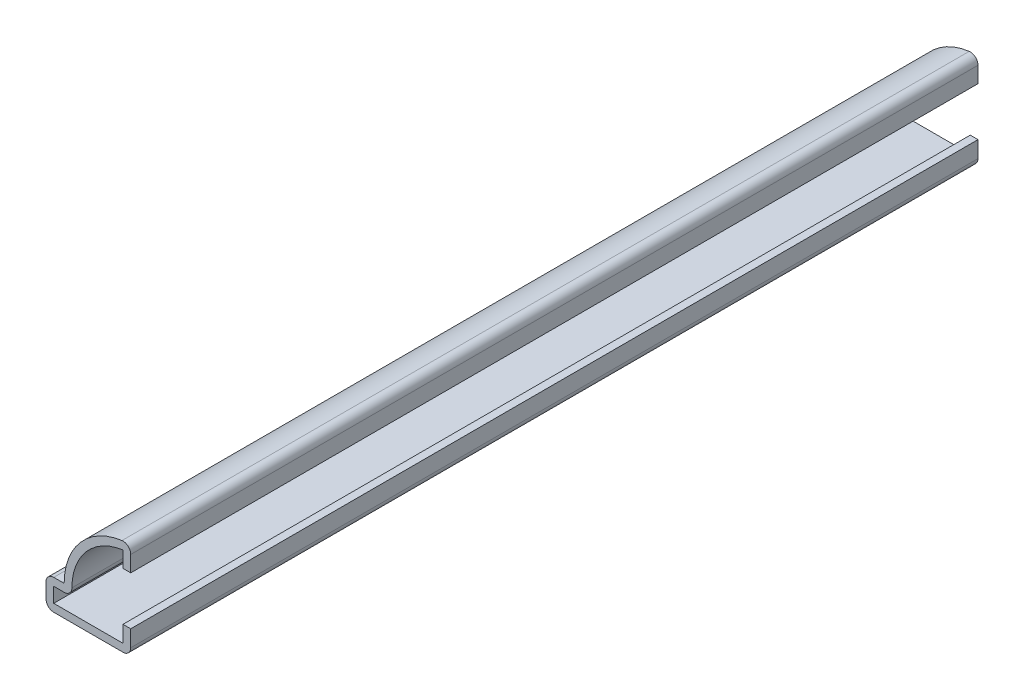
ISO-10303-21;
HEADER;
FILE_DESCRIPTION(('STEP AP214'),'2;1');
FILE_NAME('part.step','',(''),(''),'','','');
FILE_SCHEMA(('AUTOMOTIVE_DESIGN { 1 0 10303 214 1 1 1 1 }'));
ENDSEC;
DATA;
#1=APPLICATION_CONTEXT('core data for automotive mechanical design processes');
#2=APPLICATION_PROTOCOL_DEFINITION('international standard','automotive_design',2000,#1);
#3=PRODUCT_CONTEXT('',#1,'mechanical');
#4=PRODUCT('Part','Part','',(#3));
#5=PRODUCT_RELATED_PRODUCT_CATEGORY('part','',(#4));
#6=PRODUCT_DEFINITION_FORMATION('','',#4);
#7=PRODUCT_DEFINITION_CONTEXT('part definition',#1,'design');
#8=PRODUCT_DEFINITION('design','',#6,#7);
#9=PRODUCT_DEFINITION_SHAPE('','',#8);
#10=(LENGTH_UNIT() NAMED_UNIT(*) SI_UNIT(.MILLI.,.METRE.));
#11=(NAMED_UNIT(*) PLANE_ANGLE_UNIT() SI_UNIT($,.RADIAN.));
#12=(NAMED_UNIT(*) SI_UNIT($,.STERADIAN.) SOLID_ANGLE_UNIT());
#13=UNCERTAINTY_MEASURE_WITH_UNIT(LENGTH_MEASURE(1.E-05),#10,'distance_accuracy_value','');
#14=(GEOMETRIC_REPRESENTATION_CONTEXT(3) GLOBAL_UNCERTAINTY_ASSIGNED_CONTEXT((#13)) GLOBAL_UNIT_ASSIGNED_CONTEXT((#10,
#11,#12)) REPRESENTATION_CONTEXT('',''));
#15=CARTESIAN_POINT('',(0.,0.,0.));
#16=DIRECTION('',(0.,0.,1.));
#17=DIRECTION('',(1.,0.,0.));
#18=AXIS2_PLACEMENT_3D('',#15,#16,#17);
#19=CARTESIAN_POINT('',(-1.0160000000001,12.7,-111.125));
#20=DIRECTION('',(-1.,0.,0.));
#21=DIRECTION('',(0.,0.,1.));
#22=AXIS2_PLACEMENT_3D('',#19,#20,#21);
#23=PLANE('',#22);
#24=DIRECTION('',(0.,1.,0.));
#25=VECTOR('',#24,1.);
#26=CARTESIAN_POINT('',(-1.0160000000001,12.7,0.));
#27=LINE('',#26,#25);
#28=CARTESIAN_POINT('',(-1.0160000000001,11.6168103137332,0.));
#29=VERTEX_POINT('',#28);
#30=CARTESIAN_POINT('',(-1.0160000000001,9.52500000000003,0.));
#31=VERTEX_POINT('',#30);
#32=EDGE_CURVE('E224',#29,#31,#27,.F.);
#33=ORIENTED_EDGE('',*,*,#32,.F.);
#34=DIRECTION('',(0.,0.,1.));
#35=VECTOR('',#34,1.);
#36=CARTESIAN_POINT('',(-1.0160000000001,11.6168103137332,-111.125));
#37=LINE('',#36,#35);
#38=CARTESIAN_POINT('',(-1.0160000000001,11.6168103137332,-111.125));
#39=VERTEX_POINT('',#38);
#40=EDGE_CURVE('E190',#39,#29,#37,.T.);
#41=ORIENTED_EDGE('',*,*,#40,.F.);
#42=DIRECTION('',(0.,1.,0.));
#43=VECTOR('',#42,1.);
#44=CARTESIAN_POINT('',(-1.0160000000001,12.7,-111.125));
#45=LINE('',#44,#43);
#46=CARTESIAN_POINT('',(-1.0160000000001,9.52500000000003,-111.125));
#47=VERTEX_POINT('',#46);
#48=EDGE_CURVE('E171',#39,#47,#45,.F.);
#49=ORIENTED_EDGE('',*,*,#48,.T.);
#50=DIRECTION('',(0.,0.,1.));
#51=VECTOR('',#50,1.);
#52=CARTESIAN_POINT('',(-1.0160000000001,9.52500000000003,-111.125));
#53=LINE('',#52,#51);
#54=EDGE_CURVE('E178',#47,#31,#53,.T.);
#55=ORIENTED_EDGE('',*,*,#54,.T.);
#56=EDGE_LOOP('',(#33,#41,#49,#55));
#57=FACE_BOUND('',#56,.T.);
#58=ADVANCED_FACE('F35',(#57),#23,.T.);
#59=CARTESIAN_POINT('',(0.,3.96875000000001,-111.125));
#60=DIRECTION('',(0.,0.,1.));
#61=DIRECTION('',(1.,0.,0.));
#62=AXIS2_PLACEMENT_3D('',#59,#60,#61);
#63=CYLINDRICAL_SURFACE('',#62,7.71525000000003);
#64=CARTESIAN_POINT('',(0.,3.96875000000001,0.));
#65=DIRECTION('',(0.,0.,1.));
#66=DIRECTION('',(1.,0.,0.));
#67=AXIS2_PLACEMENT_3D('',#64,#65,#66);
#68=CIRCLE('',#67,7.71525000000003);
#69=CARTESIAN_POINT('',(-7.71525000000003,3.96875000000002,0.));
#70=VERTEX_POINT('',#69);
#71=EDGE_CURVE('E191',#70,#29,#68,.F.);
#72=ORIENTED_EDGE('',*,*,#71,.F.);
#73=DIRECTION('',(0.,0.,1.));
#74=VECTOR('',#73,1.);
#75=CARTESIAN_POINT('',(-7.71525000000003,3.96875000000002,-111.125));
#76=LINE('',#75,#74);
#77=CARTESIAN_POINT('',(-7.71525000000003,3.96875000000002,-111.125));
#78=VERTEX_POINT('',#77);
#79=EDGE_CURVE('E306',#70,#78,#76,.F.);
#80=ORIENTED_EDGE('',*,*,#79,.T.);
#81=CARTESIAN_POINT('',(0.,3.96875000000001,-111.125));
#82=DIRECTION('',(0.,0.,1.));
#83=DIRECTION('',(1.,0.,0.));
#84=AXIS2_PLACEMENT_3D('',#81,#82,#83);
#85=CIRCLE('',#84,7.71525000000003);
#86=EDGE_CURVE('E186',#78,#39,#85,.F.);
#87=ORIENTED_EDGE('',*,*,#86,.T.);
#88=ORIENTED_EDGE('',*,*,#40,.T.);
#89=EDGE_LOOP('',(#72,#80,#87,#88));
#90=FACE_BOUND('',#89,.T.);
#91=ADVANCED_FACE('F322',(#90),#63,.F.);
#92=CARTESIAN_POINT('',(-11.1125,2.95275000000002,-111.125));
#93=DIRECTION('',(0.,-1.,0.));
#94=DIRECTION('',(1.,0.,0.));
#95=AXIS2_PLACEMENT_3D('',#92,#93,#94);
#96=PLANE('',#95);
#97=DIRECTION('',(1.,0.,0.));
#98=VECTOR('',#97,1.);
#99=CARTESIAN_POINT('',(-11.1125,2.95275000000002,-111.125));
#100=LINE('',#99,#98);
#101=CARTESIAN_POINT('',(-10.0965,2.95275000000002,-111.125));
#102=VERTEX_POINT('',#101);
#103=CARTESIAN_POINT('',(-8.73125000000003,2.95275000000002,-111.125));
#104=VERTEX_POINT('',#103);
#105=EDGE_CURVE('E220',#102,#104,#100,.T.);
#106=ORIENTED_EDGE('',*,*,#105,.T.);
#107=DIRECTION('',(0.,0.,1.));
#108=VECTOR('',#107,1.);
#109=CARTESIAN_POINT('',(-8.73125000000003,2.95275000000002,-111.125));
#110=LINE('',#109,#108);
#111=CARTESIAN_POINT('',(-8.73125000000003,2.95275000000002,0.));
#112=VERTEX_POINT('',#111);
#113=EDGE_CURVE('E303',#104,#112,#110,.T.);
#114=ORIENTED_EDGE('',*,*,#113,.T.);
#115=DIRECTION('',(1.,0.,0.));
#116=VECTOR('',#115,1.);
#117=CARTESIAN_POINT('',(-11.1125,2.95275000000002,0.));
#118=LINE('',#117,#116);
#119=CARTESIAN_POINT('',(-10.0965,2.95275000000002,0.));
#120=VERTEX_POINT('',#119);
#121=EDGE_CURVE('E193',#120,#112,#118,.T.);
#122=ORIENTED_EDGE('',*,*,#121,.F.);
#123=DIRECTION('',(0.,0.,1.));
#124=VECTOR('',#123,1.);
#125=CARTESIAN_POINT('',(-10.0965,2.95275000000002,-111.125));
#126=LINE('',#125,#124);
#127=EDGE_CURVE('E257',#102,#120,#126,.T.);
#128=ORIENTED_EDGE('',*,*,#127,.F.);
#129=EDGE_LOOP('',(#106,#114,#122,#128));
#130=FACE_BOUND('',#129,.T.);
#131=ADVANCED_FACE('F330',(#130),#96,.T.);
#132=CARTESIAN_POINT('',(-10.0965,0.,-111.125));
#133=DIRECTION('',(1.,0.,0.));
#134=DIRECTION('',(0.,0.,-1.));
#135=AXIS2_PLACEMENT_3D('',#132,#133,#134);
#136=PLANE('',#135);
#137=DIRECTION('',(0.,1.,0.));
#138=VECTOR('',#137,1.);
#139=CARTESIAN_POINT('',(-10.0965,0.,0.));
#140=LINE('',#139,#138);
#141=CARTESIAN_POINT('',(-10.0965,1.016,0.));
#142=VERTEX_POINT('',#141);
#143=EDGE_CURVE('E250',#142,#120,#140,.T.);
#144=ORIENTED_EDGE('',*,*,#143,.F.);
#145=DIRECTION('',(0.,0.,1.));
#146=VECTOR('',#145,1.);
#147=CARTESIAN_POINT('',(-10.0965,1.016,-111.125));
#148=LINE('',#147,#146);
#149=CARTESIAN_POINT('',(-10.0965,1.016,-111.125));
#150=VERTEX_POINT('',#149);
#151=EDGE_CURVE('E259',#150,#142,#148,.T.);
#152=ORIENTED_EDGE('',*,*,#151,.F.);
#153=DIRECTION('',(0.,1.,0.));
#154=VECTOR('',#153,1.);
#155=CARTESIAN_POINT('',(-10.0965,0.,-111.125));
#156=LINE('',#155,#154);
#157=EDGE_CURVE('E217',#150,#102,#156,.T.);
#158=ORIENTED_EDGE('',*,*,#157,.T.);
#159=ORIENTED_EDGE('',*,*,#127,.T.);
#160=EDGE_LOOP('',(#144,#152,#158,#159));
#161=FACE_BOUND('',#160,.T.);
#162=ADVANCED_FACE('F334',(#161),#136,.T.);
#163=CARTESIAN_POINT('',(0.,1.016,-111.125));
#164=DIRECTION('',(0.,1.,0.));
#165=DIRECTION('',(-1.,0.,0.));
#166=AXIS2_PLACEMENT_3D('',#163,#164,#165);
#167=PLANE('',#166);
#168=DIRECTION('',(-1.,0.,0.));
#169=VECTOR('',#168,1.);
#170=CARTESIAN_POINT('',(0.,1.016,0.));
#171=LINE('',#170,#169);
#172=CARTESIAN_POINT('',(-1.016,1.016,0.));
#173=VERTEX_POINT('',#172);
#174=EDGE_CURVE('E247',#173,#142,#171,.T.);
#175=ORIENTED_EDGE('',*,*,#174,.F.);
#176=DIRECTION('',(0.,0.,1.));
#177=VECTOR('',#176,1.);
#178=CARTESIAN_POINT('',(-1.016,1.016,-111.125));
#179=LINE('',#178,#177);
#180=CARTESIAN_POINT('',(-1.016,1.016,-111.125));
#181=VERTEX_POINT('',#180);
#182=EDGE_CURVE('E261',#181,#173,#179,.T.);
#183=ORIENTED_EDGE('',*,*,#182,.F.);
#184=DIRECTION('',(-1.,0.,0.));
#185=VECTOR('',#184,1.);
#186=CARTESIAN_POINT('',(0.,1.016,-111.125));
#187=LINE('',#186,#185);
#188=EDGE_CURVE('E214',#181,#150,#187,.T.);
#189=ORIENTED_EDGE('',*,*,#188,.T.);
#190=ORIENTED_EDGE('',*,*,#151,.T.);
#191=EDGE_LOOP('',(#175,#183,#189,#190));
#192=FACE_BOUND('',#191,.T.);
#193=ADVANCED_FACE('F339',(#192),#167,.T.);
#194=CARTESIAN_POINT('',(-1.016,3.17500000000001,-111.125));
#195=DIRECTION('',(-1.,0.,0.));
#196=DIRECTION('',(0.,0.,1.));
#197=AXIS2_PLACEMENT_3D('',#194,#195,#196);
#198=PLANE('',#197);
#199=DIRECTION('',(0.,1.,0.));
#200=VECTOR('',#199,1.);
#201=CARTESIAN_POINT('',(-1.016,3.17500000000001,0.));
#202=LINE('',#201,#200);
#203=CARTESIAN_POINT('',(-1.016,3.17500000000001,0.));
#204=VERTEX_POINT('',#203);
#205=EDGE_CURVE('E244',#204,#173,#202,.F.);
#206=ORIENTED_EDGE('',*,*,#205,.F.);
#207=DIRECTION('',(0.,0.,1.));
#208=VECTOR('',#207,1.);
#209=CARTESIAN_POINT('',(-1.016,3.17500000000001,-111.125));
#210=LINE('',#209,#208);
#211=CARTESIAN_POINT('',(-1.016,3.17500000000001,-111.125));
#212=VERTEX_POINT('',#211);
#213=EDGE_CURVE('E263',#212,#204,#210,.T.);
#214=ORIENTED_EDGE('',*,*,#213,.F.);
#215=DIRECTION('',(0.,1.,0.));
#216=VECTOR('',#215,1.);
#217=CARTESIAN_POINT('',(-1.016,3.17500000000001,-111.125));
#218=LINE('',#217,#216);
#219=EDGE_CURVE('E211',#212,#181,#218,.F.);
#220=ORIENTED_EDGE('',*,*,#219,.T.);
#221=ORIENTED_EDGE('',*,*,#182,.T.);
#222=EDGE_LOOP('',(#206,#214,#220,#221));
#223=FACE_BOUND('',#222,.T.);
#224=ADVANCED_FACE('F342',(#223),#198,.T.);
#225=CARTESIAN_POINT('',(-1.016,3.17500000000001,-111.125));
#226=DIRECTION('',(0.,-1.,0.));
#227=DIRECTION('',(0.,0.,-1.));
#228=AXIS2_PLACEMENT_3D('',#225,#226,#227);
#229=PLANE('',#228);
#230=DIRECTION('',(1.,0.,0.));
#231=VECTOR('',#230,1.);
#232=CARTESIAN_POINT('',(-1.016,3.17500000000001,0.));
#233=LINE('',#232,#231);
#234=CARTESIAN_POINT('',(0.,3.17500000000001,0.));
#235=VERTEX_POINT('',#234);
#236=EDGE_CURVE('E242',#204,#235,#233,.T.);
#237=ORIENTED_EDGE('',*,*,#236,.T.);
#238=DIRECTION('',(0.,0.,1.));
#239=VECTOR('',#238,1.);
#240=CARTESIAN_POINT('',(0.,3.17500000000001,-111.125));
#241=LINE('',#240,#239);
#242=CARTESIAN_POINT('',(0.,3.17500000000001,-111.125));
#243=VERTEX_POINT('',#242);
#244=EDGE_CURVE('E265',#243,#235,#241,.T.);
#245=ORIENTED_EDGE('',*,*,#244,.F.);
#246=DIRECTION('',(1.,0.,0.));
#247=VECTOR('',#246,1.);
#248=CARTESIAN_POINT('',(-1.016,3.17500000000001,-111.125));
#249=LINE('',#248,#247);
#250=EDGE_CURVE('E209',#212,#243,#249,.T.);
#251=ORIENTED_EDGE('',*,*,#250,.F.);
#252=ORIENTED_EDGE('',*,*,#213,.T.);
#253=EDGE_LOOP('',(#237,#245,#251,#252));
#254=FACE_BOUND('',#253,.T.);
#255=ADVANCED_FACE('F348',(#254),#229,.F.);
#256=CARTESIAN_POINT('',(0.,3.17500000000001,-111.125));
#257=DIRECTION('',(-1.,0.,0.));
#258=DIRECTION('',(0.,0.,1.));
#259=AXIS2_PLACEMENT_3D('',#256,#257,#258);
#260=PLANE('',#259);
#261=DIRECTION('',(0.,-1.,0.));
#262=VECTOR('',#261,1.);
#263=CARTESIAN_POINT('',(0.,3.17500000000001,0.));
#264=LINE('',#263,#262);
#265=CARTESIAN_POINT('',(0.,1.016,0.));
#266=VERTEX_POINT('',#265);
#267=EDGE_CURVE('E239',#235,#266,#264,.T.);
#268=ORIENTED_EDGE('',*,*,#267,.T.);
#269=DIRECTION('',(0.,0.,1.));
#270=VECTOR('',#269,1.);
#271=CARTESIAN_POINT('',(0.,1.016,-111.125));
#272=LINE('',#271,#270);
#273=CARTESIAN_POINT('',(0.,1.016,-111.125));
#274=VERTEX_POINT('',#273);
#275=EDGE_CURVE('E308',#266,#274,#272,.F.);
#276=ORIENTED_EDGE('',*,*,#275,.T.);
#277=DIRECTION('',(0.,-1.,0.));
#278=VECTOR('',#277,1.);
#279=CARTESIAN_POINT('',(0.,3.17500000000001,-111.125));
#280=LINE('',#279,#278);
#281=EDGE_CURVE('E206',#243,#274,#280,.T.);
#282=ORIENTED_EDGE('',*,*,#281,.F.);
#283=ORIENTED_EDGE('',*,*,#244,.T.);
#284=EDGE_LOOP('',(#268,#276,#282,#283));
#285=FACE_BOUND('',#284,.T.);
#286=ADVANCED_FACE('F352',(#285),#260,.F.);
#287=CARTESIAN_POINT('',(0.,0.,-111.125));
#288=DIRECTION('',(0.,1.,0.));
#289=DIRECTION('',(-1.,0.,0.));
#290=AXIS2_PLACEMENT_3D('',#287,#288,#289);
#291=PLANE('',#290);
#292=DIRECTION('',(-1.,0.,0.));
#293=VECTOR('',#292,1.);
#294=CARTESIAN_POINT('',(0.,0.,0.));
#295=LINE('',#294,#293);
#296=CARTESIAN_POINT('',(-1.016,0.,0.));
#297=VERTEX_POINT('',#296);
#298=CARTESIAN_POINT('',(-10.0965,0.,0.));
#299=VERTEX_POINT('',#298);
#300=EDGE_CURVE('E236',#297,#299,#295,.T.);
#301=ORIENTED_EDGE('',*,*,#300,.T.);
#302=DIRECTION('',(0.,0.,1.));
#303=VECTOR('',#302,1.);
#304=CARTESIAN_POINT('',(-10.0965,0.,-111.125));
#305=LINE('',#304,#303);
#306=CARTESIAN_POINT('',(-10.0965,0.,-111.125));
#307=VERTEX_POINT('',#306);
#308=EDGE_CURVE('E289',#299,#307,#305,.F.);
#309=ORIENTED_EDGE('',*,*,#308,.T.);
#310=DIRECTION('',(-1.,0.,0.));
#311=VECTOR('',#310,1.);
#312=CARTESIAN_POINT('',(0.,0.,-111.125));
#313=LINE('',#312,#311);
#314=CARTESIAN_POINT('',(-1.016,0.,-111.125));
#315=VERTEX_POINT('',#314);
#316=EDGE_CURVE('E204',#315,#307,#313,.T.);
#317=ORIENTED_EDGE('',*,*,#316,.F.);
#318=DIRECTION('',(0.,0.,1.));
#319=VECTOR('',#318,1.);
#320=CARTESIAN_POINT('',(-1.016,0.,-111.125));
#321=LINE('',#320,#319);
#322=EDGE_CURVE('E286',#315,#297,#321,.T.);
#323=ORIENTED_EDGE('',*,*,#322,.T.);
#324=EDGE_LOOP('',(#301,#309,#317,#323));
#325=FACE_BOUND('',#324,.T.);
#326=ADVANCED_FACE('F360',(#325),#291,.F.);
#327=CARTESIAN_POINT('',(-11.1125,0.,-111.125));
#328=DIRECTION('',(1.,0.,0.));
#329=DIRECTION('',(0.,0.,-1.));
#330=AXIS2_PLACEMENT_3D('',#327,#328,#329);
#331=PLANE('',#330);
#332=DIRECTION('',(0.,1.,0.));
#333=VECTOR('',#332,1.);
#334=CARTESIAN_POINT('',(-11.1125,0.,-111.125));
#335=LINE('',#334,#333);
#336=CARTESIAN_POINT('',(-11.1125,1.016,-111.125));
#337=VERTEX_POINT('',#336);
#338=CARTESIAN_POINT('',(-11.1125,2.95275000000002,-111.125));
#339=VERTEX_POINT('',#338);
#340=EDGE_CURVE('E201',#337,#339,#335,.T.);
#341=ORIENTED_EDGE('',*,*,#340,.F.);
#342=DIRECTION('',(0.,0.,1.));
#343=VECTOR('',#342,1.);
#344=CARTESIAN_POINT('',(-11.1125,1.016,-111.125));
#345=LINE('',#344,#343);
#346=CARTESIAN_POINT('',(-11.1125,1.016,0.));
#347=VERTEX_POINT('',#346);
#348=EDGE_CURVE('E273',#337,#347,#345,.T.);
#349=ORIENTED_EDGE('',*,*,#348,.T.);
#350=DIRECTION('',(0.,1.,0.));
#351=VECTOR('',#350,1.);
#352=CARTESIAN_POINT('',(-11.1125,0.,0.));
#353=LINE('',#352,#351);
#354=CARTESIAN_POINT('',(-11.1125,2.95275000000002,0.));
#355=VERTEX_POINT('',#354);
#356=EDGE_CURVE('E233',#347,#355,#353,.T.);
#357=ORIENTED_EDGE('',*,*,#356,.T.);
#358=DIRECTION('',(0.,0.,1.));
#359=VECTOR('',#358,1.);
#360=CARTESIAN_POINT('',(-11.1125,2.95275000000002,-111.125));
#361=LINE('',#360,#359);
#362=EDGE_CURVE('E256',#355,#339,#361,.F.);
#363=ORIENTED_EDGE('',*,*,#362,.T.);
#364=EDGE_LOOP('',(#341,#349,#357,#363));
#365=FACE_BOUND('',#364,.T.);
#366=ADVANCED_FACE('F369',(#365),#331,.F.);
#367=CARTESIAN_POINT('',(-11.1125,3.96875000000002,-111.125));
#368=DIRECTION('',(0.,-1.,0.));
#369=DIRECTION('',(1.,0.,0.));
#370=AXIS2_PLACEMENT_3D('',#367,#368,#369);
#371=PLANE('',#370);
#372=DIRECTION('',(1.,0.,0.));
#373=VECTOR('',#372,1.);
#374=CARTESIAN_POINT('',(-11.1125,3.96875000000002,-111.125));
#375=LINE('',#374,#373);
#376=CARTESIAN_POINT('',(-10.0965,3.96875000000002,-111.125));
#377=VERTEX_POINT('',#376);
#378=CARTESIAN_POINT('',(-8.73125000000003,3.96875000000002,-111.125));
#379=VERTEX_POINT('',#378);
#380=EDGE_CURVE('E199',#377,#379,#375,.T.);
#381=ORIENTED_EDGE('',*,*,#380,.F.);
#382=DIRECTION('',(0.,0.,1.));
#383=VECTOR('',#382,1.);
#384=CARTESIAN_POINT('',(-10.0965,3.96875000000002,-111.125));
#385=LINE('',#384,#383);
#386=CARTESIAN_POINT('',(-10.0965,3.96875000000002,0.));
#387=VERTEX_POINT('',#386);
#388=EDGE_CURVE('E300',#377,#387,#385,.T.);
#389=ORIENTED_EDGE('',*,*,#388,.T.);
#390=DIRECTION('',(1.,0.,0.));
#391=VECTOR('',#390,1.);
#392=CARTESIAN_POINT('',(-11.1125,3.96875000000002,0.));
#393=LINE('',#392,#391);
#394=CARTESIAN_POINT('',(-8.73125000000003,3.96875000000002,0.));
#395=VERTEX_POINT('',#394);
#396=EDGE_CURVE('E231',#387,#395,#393,.T.);
#397=ORIENTED_EDGE('',*,*,#396,.T.);
#398=DIRECTION('',(0.,0.,1.));
#399=VECTOR('',#398,1.);
#400=CARTESIAN_POINT('',(-8.73125000000003,3.96875000000002,-111.125));
#401=LINE('',#400,#399);
#402=EDGE_CURVE('E268',#379,#395,#401,.T.);
#403=ORIENTED_EDGE('',*,*,#402,.F.);
#404=EDGE_LOOP('',(#381,#389,#397,#403));
#405=FACE_BOUND('',#404,.T.);
#406=ADVANCED_FACE('F377',(#405),#371,.F.);
#407=CARTESIAN_POINT('',(0.,3.96875000000001,-111.125));
#408=DIRECTION('',(0.,0.,1.));
#409=DIRECTION('',(1.,0.,0.));
#410=AXIS2_PLACEMENT_3D('',#407,#408,#409);
#411=CYLINDRICAL_SURFACE('',#410,8.73125000000003);
#412=CARTESIAN_POINT('',(0.,3.96875000000001,0.));
#413=DIRECTION('',(0.,0.,-1.));
#414=DIRECTION('',(-1.,0.,0.));
#415=AXIS2_PLACEMENT_3D('',#412,#413,#414);
#416=CIRCLE('',#415,8.73125000000003);
#417=CARTESIAN_POINT('',(-1.14979423868324,12.6239622892042,0.));
#418=VERTEX_POINT('',#417);
#419=EDGE_CURVE('E229',#395,#418,#416,.T.);
#420=ORIENTED_EDGE('',*,*,#419,.T.);
#421=DIRECTION('',(0.,0.,1.));
#422=VECTOR('',#421,1.);
#423=CARTESIAN_POINT('',(-1.14979423868324,12.6239622892042,-111.125));
#424=LINE('',#423,#422);
#425=CARTESIAN_POINT('',(-1.14979423868324,12.6239622892042,-111.125));
#426=VERTEX_POINT('',#425);
#427=EDGE_CURVE('E11',#418,#426,#424,.F.);
#428=ORIENTED_EDGE('',*,*,#427,.T.);
#429=CARTESIAN_POINT('',(0.,3.96875000000001,-111.125));
#430=DIRECTION('',(0.,0.,-1.));
#431=DIRECTION('',(-1.,0.,0.));
#432=AXIS2_PLACEMENT_3D('',#429,#430,#431);
#433=CIRCLE('',#432,8.73125000000003);
#434=EDGE_CURVE('E197',#379,#426,#433,.T.);
#435=ORIENTED_EDGE('',*,*,#434,.F.);
#436=ORIENTED_EDGE('',*,*,#402,.T.);
#437=EDGE_LOOP('',(#420,#428,#435,#436));
#438=FACE_BOUND('',#437,.T.);
#439=ADVANCED_FACE('F379',(#438),#411,.T.);
#440=CARTESIAN_POINT('',(0.,12.7,-111.125));
#441=DIRECTION('',(-1.,0.,0.));
#442=DIRECTION('',(0.,0.,1.));
#443=AXIS2_PLACEMENT_3D('',#440,#441,#442);
#444=PLANE('',#443);
#445=DIRECTION('',(0.,-1.,0.));
#446=VECTOR('',#445,1.);
#447=CARTESIAN_POINT('',(0.,12.7,-111.125));
#448=LINE('',#447,#446);
#449=CARTESIAN_POINT('',(0.,11.6168103137332,-111.125));
#450=VERTEX_POINT('',#449);
#451=CARTESIAN_POINT('',(0.,9.52500000000003,-111.125));
#452=VERTEX_POINT('',#451);
#453=EDGE_CURVE('E172',#450,#452,#448,.T.);
#454=ORIENTED_EDGE('',*,*,#453,.F.);
#455=DIRECTION('',(0.,0.,1.));
#456=VECTOR('',#455,1.);
#457=CARTESIAN_POINT('',(0.,11.6168103137332,-111.125));
#458=LINE('',#457,#456);
#459=CARTESIAN_POINT('',(0.,11.6168103137332,0.));
#460=VERTEX_POINT('',#459);
#461=EDGE_CURVE('E43',#450,#460,#458,.T.);
#462=ORIENTED_EDGE('',*,*,#461,.T.);
#463=DIRECTION('',(0.,-1.,0.));
#464=VECTOR('',#463,1.);
#465=CARTESIAN_POINT('',(0.,12.7,0.));
#466=LINE('',#465,#464);
#467=CARTESIAN_POINT('',(0.,9.52500000000003,0.));
#468=VERTEX_POINT('',#467);
#469=EDGE_CURVE('E227',#460,#468,#466,.T.);
#470=ORIENTED_EDGE('',*,*,#469,.T.);
#471=DIRECTION('',(0.,0.,1.));
#472=VECTOR('',#471,1.);
#473=CARTESIAN_POINT('',(0.,9.52500000000003,-111.125));
#474=LINE('',#473,#472);
#475=EDGE_CURVE('E185',#452,#468,#474,.T.);
#476=ORIENTED_EDGE('',*,*,#475,.F.);
#477=EDGE_LOOP('',(#454,#462,#470,#476));
#478=FACE_BOUND('',#477,.T.);
#479=ADVANCED_FACE('F313',(#478),#444,.F.);
#480=CARTESIAN_POINT('',(0.,9.52500000000003,-111.125));
#481=DIRECTION('',(0.,1.,0.));
#482=DIRECTION('',(0.,0.,1.));
#483=AXIS2_PLACEMENT_3D('',#480,#481,#482);
#484=PLANE('',#483);
#485=DIRECTION('',(-1.,0.,0.));
#486=VECTOR('',#485,1.);
#487=CARTESIAN_POINT('',(0.,9.52500000000003,0.));
#488=LINE('',#487,#486);
#489=EDGE_CURVE('E181',#468,#31,#488,.T.);
#490=ORIENTED_EDGE('',*,*,#489,.T.);
#491=ORIENTED_EDGE('',*,*,#54,.F.);
#492=DIRECTION('',(-1.,0.,0.));
#493=VECTOR('',#492,1.);
#494=CARTESIAN_POINT('',(0.,9.52500000000003,-111.125));
#495=LINE('',#494,#493);
#496=EDGE_CURVE('E165',#452,#47,#495,.T.);
#497=ORIENTED_EDGE('',*,*,#496,.F.);
#498=ORIENTED_EDGE('',*,*,#475,.T.);
#499=EDGE_LOOP('',(#490,#491,#497,#498));
#500=FACE_BOUND('',#499,.T.);
#501=ADVANCED_FACE('F179',(#500),#484,.F.);
#502=CARTESIAN_POINT('',(0.,3.96875000000001,-111.125));
#503=DIRECTION('',(0.,0.,-1.));
#504=DIRECTION('',(-1.,0.,0.));
#505=AXIS2_PLACEMENT_3D('',#502,#503,#504);
#506=PLANE('',#505);
#507=ORIENTED_EDGE('',*,*,#316,.T.);
#508=CARTESIAN_POINT('',(-10.0965,1.016,-111.125));
#509=DIRECTION('',(0.,0.,-1.));
#510=DIRECTION('',(-1.,0.,0.));
#511=AXIS2_PLACEMENT_3D('',#508,#509,#510);
#512=CIRCLE('',#511,1.016);
#513=EDGE_CURVE('E298',#307,#337,#512,.T.);
#514=ORIENTED_EDGE('',*,*,#513,.T.);
#515=ORIENTED_EDGE('',*,*,#340,.T.);
#516=CARTESIAN_POINT('',(-10.0965,2.95275000000002,-111.125));
#517=DIRECTION('',(0.,0.,-1.));
#518=DIRECTION('',(-1.,0.,0.));
#519=AXIS2_PLACEMENT_3D('',#516,#517,#518);
#520=CIRCLE('',#519,1.016);
#521=EDGE_CURVE('E296',#339,#377,#520,.T.);
#522=ORIENTED_EDGE('',*,*,#521,.T.);
#523=ORIENTED_EDGE('',*,*,#380,.T.);
#524=ORIENTED_EDGE('',*,*,#434,.T.);
#525=CARTESIAN_POINT('',(-1.0160000000001,11.6168103137332,-111.125));
#526=DIRECTION('',(0.,0.,-1.));
#527=DIRECTION('',(-1.,0.,0.));
#528=AXIS2_PLACEMENT_3D('',#525,#526,#527);
#529=CIRCLE('',#528,1.016);
#530=EDGE_CURVE('E50',#426,#450,#529,.T.);
#531=ORIENTED_EDGE('',*,*,#530,.T.);
#532=ORIENTED_EDGE('',*,*,#453,.T.);
#533=ORIENTED_EDGE('',*,*,#496,.T.);
#534=ORIENTED_EDGE('',*,*,#48,.F.);
#535=ORIENTED_EDGE('',*,*,#86,.F.);
#536=CARTESIAN_POINT('',(-8.73125000000003,3.96875000000002,-111.125));
#537=DIRECTION('',(0.,0.,-1.));
#538=DIRECTION('',(-1.,0.,0.));
#539=AXIS2_PLACEMENT_3D('',#536,#537,#538);
#540=CIRCLE('',#539,1.016);
#541=EDGE_CURVE('E294',#78,#104,#540,.T.);
#542=ORIENTED_EDGE('',*,*,#541,.T.);
#543=ORIENTED_EDGE('',*,*,#105,.F.);
#544=ORIENTED_EDGE('',*,*,#157,.F.);
#545=ORIENTED_EDGE('',*,*,#188,.F.);
#546=ORIENTED_EDGE('',*,*,#219,.F.);
#547=ORIENTED_EDGE('',*,*,#250,.T.);
#548=ORIENTED_EDGE('',*,*,#281,.T.);
#549=CARTESIAN_POINT('',(-1.016,1.016,-111.125));
#550=DIRECTION('',(0.,0.,-1.));
#551=DIRECTION('',(-1.,0.,0.));
#552=AXIS2_PLACEMENT_3D('',#549,#550,#551);
#553=CIRCLE('',#552,1.016);
#554=EDGE_CURVE('E292',#274,#315,#553,.T.);
#555=ORIENTED_EDGE('',*,*,#554,.T.);
#556=EDGE_LOOP('',(#507,#514,#515,#522,#523,#524,#531,#532,#533,#534,#535,#542,#543,#544,#545,
#546,#547,#548,#555));
#557=FACE_BOUND('',#556,.T.);
#558=ADVANCED_FACE('F168',(#557),#506,.T.);
#559=CARTESIAN_POINT('',(0.,3.96875000000001,0.));
#560=DIRECTION('',(0.,0.,-1.));
#561=DIRECTION('',(-1.,0.,0.));
#562=AXIS2_PLACEMENT_3D('',#559,#560,#561);
#563=PLANE('',#562);
#564=ORIENTED_EDGE('',*,*,#356,.F.);
#565=CARTESIAN_POINT('',(-10.0965,1.016,0.));
#566=DIRECTION('',(0.,0.,-1.));
#567=DIRECTION('',(-1.,0.,0.));
#568=AXIS2_PLACEMENT_3D('',#565,#566,#567);
#569=CIRCLE('',#568,1.016);
#570=EDGE_CURVE('E284',#347,#299,#569,.F.);
#571=ORIENTED_EDGE('',*,*,#570,.T.);
#572=ORIENTED_EDGE('',*,*,#300,.F.);
#573=CARTESIAN_POINT('',(-1.016,1.016,0.));
#574=DIRECTION('',(0.,0.,-1.));
#575=DIRECTION('',(-1.,0.,0.));
#576=AXIS2_PLACEMENT_3D('',#573,#574,#575);
#577=CIRCLE('',#576,1.016);
#578=EDGE_CURVE('E278',#297,#266,#577,.F.);
#579=ORIENTED_EDGE('',*,*,#578,.T.);
#580=ORIENTED_EDGE('',*,*,#267,.F.);
#581=ORIENTED_EDGE('',*,*,#236,.F.);
#582=ORIENTED_EDGE('',*,*,#205,.T.);
#583=ORIENTED_EDGE('',*,*,#174,.T.);
#584=ORIENTED_EDGE('',*,*,#143,.T.);
#585=ORIENTED_EDGE('',*,*,#121,.T.);
#586=CARTESIAN_POINT('',(-8.73125000000003,3.96875000000002,0.));
#587=DIRECTION('',(0.,0.,-1.));
#588=DIRECTION('',(-1.,0.,0.));
#589=AXIS2_PLACEMENT_3D('',#586,#587,#588);
#590=CIRCLE('',#589,1.016);
#591=EDGE_CURVE('E280',#112,#70,#590,.F.);
#592=ORIENTED_EDGE('',*,*,#591,.T.);
#593=ORIENTED_EDGE('',*,*,#71,.T.);
#594=ORIENTED_EDGE('',*,*,#32,.T.);
#595=ORIENTED_EDGE('',*,*,#489,.F.);
#596=ORIENTED_EDGE('',*,*,#469,.F.);
#597=CARTESIAN_POINT('',(-1.0160000000001,11.6168103137332,0.));
#598=DIRECTION('',(0.,0.,-1.));
#599=DIRECTION('',(-1.,0.,0.));
#600=AXIS2_PLACEMENT_3D('',#597,#598,#599);
#601=CIRCLE('',#600,1.016);
#602=EDGE_CURVE('E276',#460,#418,#601,.F.);
#603=ORIENTED_EDGE('',*,*,#602,.T.);
#604=ORIENTED_EDGE('',*,*,#419,.F.);
#605=ORIENTED_EDGE('',*,*,#396,.F.);
#606=CARTESIAN_POINT('',(-10.0965,2.95275000000002,0.));
#607=DIRECTION('',(0.,0.,-1.));
#608=DIRECTION('',(-1.,0.,0.));
#609=AXIS2_PLACEMENT_3D('',#606,#607,#608);
#610=CIRCLE('',#609,1.016);
#611=EDGE_CURVE('E282',#387,#355,#610,.F.);
#612=ORIENTED_EDGE('',*,*,#611,.T.);
#613=EDGE_LOOP('',(#564,#571,#572,#579,#580,#581,#582,#583,#584,#585,#592,#593,#594,#595,#596,
#603,#604,#605,#612));
#614=FACE_BOUND('',#613,.T.);
#615=ADVANCED_FACE('F317',(#614),#563,.F.);
#616=CARTESIAN_POINT('',(-10.0965,1.016,-111.125));
#617=DIRECTION('',(0.,0.,1.));
#618=DIRECTION('',(1.,0.,0.));
#619=AXIS2_PLACEMENT_3D('',#616,#617,#618);
#620=CYLINDRICAL_SURFACE('',#619,1.016);
#621=ORIENTED_EDGE('',*,*,#513,.F.);
#622=ORIENTED_EDGE('',*,*,#308,.F.);
#623=ORIENTED_EDGE('',*,*,#570,.F.);
#624=ORIENTED_EDGE('',*,*,#348,.F.);
#625=EDGE_LOOP('',(#621,#622,#623,#624));
#626=FACE_BOUND('',#625,.T.);
#627=ADVANCED_FACE('F364',(#626),#620,.T.);
#628=CARTESIAN_POINT('',(-10.0965,2.95275000000002,-111.125));
#629=DIRECTION('',(0.,0.,1.));
#630=DIRECTION('',(1.,0.,0.));
#631=AXIS2_PLACEMENT_3D('',#628,#629,#630);
#632=CYLINDRICAL_SURFACE('',#631,1.016);
#633=ORIENTED_EDGE('',*,*,#521,.F.);
#634=ORIENTED_EDGE('',*,*,#362,.F.);
#635=ORIENTED_EDGE('',*,*,#611,.F.);
#636=ORIENTED_EDGE('',*,*,#388,.F.);
#637=EDGE_LOOP('',(#633,#634,#635,#636));
#638=FACE_BOUND('',#637,.T.);
#639=ADVANCED_FACE('F372',(#638),#632,.T.);
#640=CARTESIAN_POINT('',(-8.73125000000003,3.96875000000002,-111.125));
#641=DIRECTION('',(0.,0.,1.));
#642=DIRECTION('',(1.,0.,0.));
#643=AXIS2_PLACEMENT_3D('',#640,#641,#642);
#644=CYLINDRICAL_SURFACE('',#643,1.016);
#645=ORIENTED_EDGE('',*,*,#541,.F.);
#646=ORIENTED_EDGE('',*,*,#79,.F.);
#647=ORIENTED_EDGE('',*,*,#591,.F.);
#648=ORIENTED_EDGE('',*,*,#113,.F.);
#649=EDGE_LOOP('',(#645,#646,#647,#648));
#650=FACE_BOUND('',#649,.T.);
#651=ADVANCED_FACE('F327',(#650),#644,.T.);
#652=CARTESIAN_POINT('',(-1.016,1.016,-111.125));
#653=DIRECTION('',(0.,0.,1.));
#654=DIRECTION('',(1.,0.,0.));
#655=AXIS2_PLACEMENT_3D('',#652,#653,#654);
#656=CYLINDRICAL_SURFACE('',#655,1.016);
#657=ORIENTED_EDGE('',*,*,#554,.F.);
#658=ORIENTED_EDGE('',*,*,#275,.F.);
#659=ORIENTED_EDGE('',*,*,#578,.F.);
#660=ORIENTED_EDGE('',*,*,#322,.F.);
#661=EDGE_LOOP('',(#657,#658,#659,#660));
#662=FACE_BOUND('',#661,.T.);
#663=ADVANCED_FACE('F355',(#662),#656,.T.);
#664=CARTESIAN_POINT('',(-1.0160000000001,11.6168103137332,-111.125));
#665=DIRECTION('',(0.,0.,1.));
#666=DIRECTION('',(1.,0.,0.));
#667=AXIS2_PLACEMENT_3D('',#664,#665,#666);
#668=CYLINDRICAL_SURFACE('',#667,1.016);
#669=ORIENTED_EDGE('',*,*,#530,.F.);
#670=ORIENTED_EDGE('',*,*,#427,.F.);
#671=ORIENTED_EDGE('',*,*,#602,.F.);
#672=ORIENTED_EDGE('',*,*,#461,.F.);
#673=EDGE_LOOP('',(#669,#670,#671,#672));
#674=FACE_BOUND('',#673,.T.);
#675=ADVANCED_FACE('F37',(#674),#668,.T.);
#676=CLOSED_SHELL('',(#58,#91,#131,#162,#193,#224,#255,#286,#326,#366,#406,#439,#479,#501,#558,
#615,#627,#639,#651,#663,#675));
#677=MANIFOLD_SOLID_BREP('B2',#676);
#678=ADVANCED_BREP_SHAPE_REPRESENTATION('',(#18,#677),#14);
#679=SHAPE_DEFINITION_REPRESENTATION(#9,#678);
ENDSEC;
END-ISO-10303-21;
